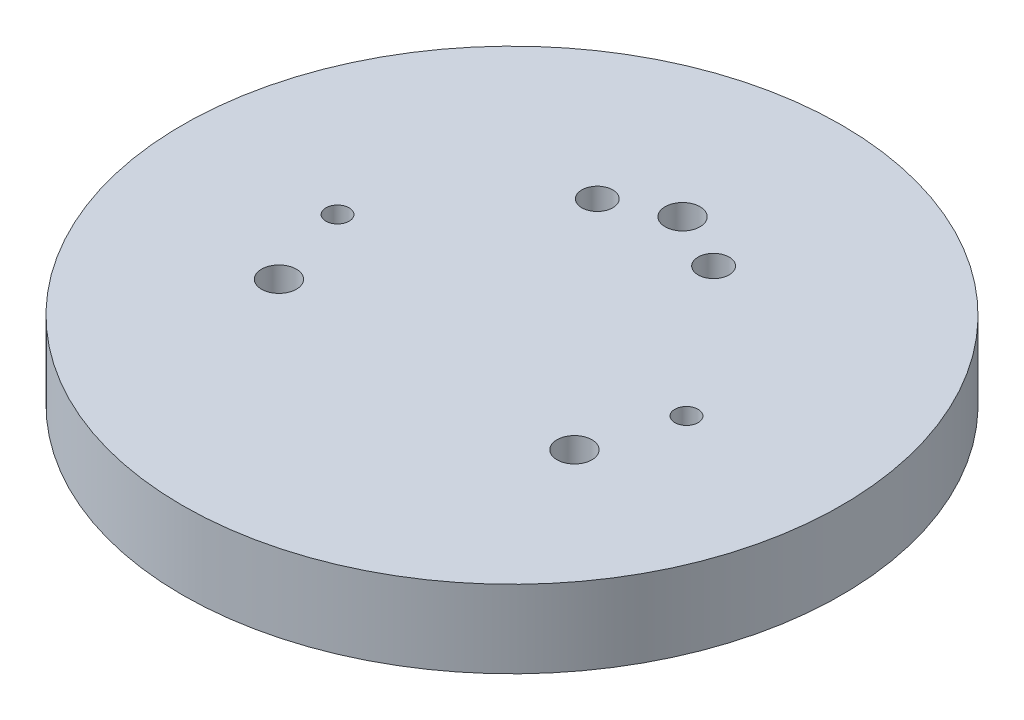
ISO-10303-21;
HEADER;
FILE_DESCRIPTION(('STEP AP214'),'2;1');
FILE_NAME('part.step','',(''),(''),'','','');
FILE_SCHEMA(('AUTOMOTIVE_DESIGN { 1 0 10303 214 1 1 1 1 }'));
ENDSEC;
DATA;
#1=APPLICATION_CONTEXT('core data for automotive mechanical design processes');
#2=APPLICATION_PROTOCOL_DEFINITION('international standard','automotive_design',2000,#1);
#3=PRODUCT_CONTEXT('',#1,'mechanical');
#4=PRODUCT('Part','Part','',(#3));
#5=PRODUCT_RELATED_PRODUCT_CATEGORY('part','',(#4));
#6=PRODUCT_DEFINITION_FORMATION('','',#4);
#7=PRODUCT_DEFINITION_CONTEXT('part definition',#1,'design');
#8=PRODUCT_DEFINITION('design','',#6,#7);
#9=PRODUCT_DEFINITION_SHAPE('','',#8);
#10=(LENGTH_UNIT() NAMED_UNIT(*) SI_UNIT(.MILLI.,.METRE.));
#11=(NAMED_UNIT(*) PLANE_ANGLE_UNIT() SI_UNIT($,.RADIAN.));
#12=(NAMED_UNIT(*) SI_UNIT($,.STERADIAN.) SOLID_ANGLE_UNIT());
#13=UNCERTAINTY_MEASURE_WITH_UNIT(LENGTH_MEASURE(1.E-05),#10,'distance_accuracy_value','');
#14=(GEOMETRIC_REPRESENTATION_CONTEXT(3) GLOBAL_UNCERTAINTY_ASSIGNED_CONTEXT((#13)) GLOBAL_UNIT_ASSIGNED_CONTEXT((#10,
#11,#12)) REPRESENTATION_CONTEXT('',''));
#15=CARTESIAN_POINT('',(0.,0.,0.));
#16=DIRECTION('',(0.,0.,1.));
#17=DIRECTION('',(1.,0.,0.));
#18=AXIS2_PLACEMENT_3D('',#15,#16,#17);
#19=CARTESIAN_POINT('',(-19.0525588832562,0.,11.0000000000008));
#20=DIRECTION('',(0.,1.,0.));
#21=DIRECTION('',(0.,0.,1.));
#22=AXIS2_PLACEMENT_3D('',#19,#20,#21);
#23=CYLINDRICAL_SURFACE('',#22,2.25000000000178);
#24=CARTESIAN_POINT('',(-19.0525588832562,10.,11.0000000000008));
#25=DIRECTION('',(0.,1.,0.));
#26=DIRECTION('',(0.,0.,1.));
#27=AXIS2_PLACEMENT_3D('',#24,#25,#26);
#28=CIRCLE('',#27,2.25000000000178);
#29=CARTESIAN_POINT('',(-19.0525588832562,10.,13.2500000000026));
#30=VERTEX_POINT('',#29);
#31=EDGE_CURVE('E70',#30,#30,#28,.T.);
#32=ORIENTED_EDGE('',*,*,#31,.T.);
#33=EDGE_LOOP('',(#32));
#34=FACE_BOUND('',#33,.T.);
#35=CARTESIAN_POINT('',(-19.0525588832562,4.4,11.0000000000008));
#36=DIRECTION('',(0.,-1.,0.));
#37=DIRECTION('',(0.,0.,-1.));
#38=AXIS2_PLACEMENT_3D('',#35,#36,#37);
#39=CIRCLE('',#38,2.25000000000178);
#40=CARTESIAN_POINT('',(-19.0525588832562,4.4,8.74999999999904));
#41=VERTEX_POINT('',#40);
#42=EDGE_CURVE('E40',#41,#41,#39,.F.);
#43=ORIENTED_EDGE('',*,*,#42,.F.);
#44=EDGE_LOOP('',(#43));
#45=FACE_BOUND('',#44,.T.);
#46=ADVANCED_FACE('F36',(#34,#45),#23,.F.);
#47=CARTESIAN_POINT('',(19.0525588832591,0.,10.9999999999992));
#48=DIRECTION('',(0.,1.,0.));
#49=DIRECTION('',(0.,0.,1.));
#50=AXIS2_PLACEMENT_3D('',#47,#48,#49);
#51=CYLINDRICAL_SURFACE('',#50,2.25000000000121);
#52=CARTESIAN_POINT('',(19.0525588832591,10.,10.9999999999992));
#53=DIRECTION('',(0.,1.,0.));
#54=DIRECTION('',(0.,0.,1.));
#55=AXIS2_PLACEMENT_3D('',#52,#53,#54);
#56=CIRCLE('',#55,2.25000000000121);
#57=CARTESIAN_POINT('',(19.0525588832591,10.,13.2500000000004));
#58=VERTEX_POINT('',#57);
#59=EDGE_CURVE('E76',#58,#58,#56,.T.);
#60=ORIENTED_EDGE('',*,*,#59,.T.);
#61=EDGE_LOOP('',(#60));
#62=FACE_BOUND('',#61,.T.);
#63=CARTESIAN_POINT('',(19.0525588832591,4.4,10.9999999999992));
#64=DIRECTION('',(0.,-1.,0.));
#65=DIRECTION('',(0.,0.,-1.));
#66=AXIS2_PLACEMENT_3D('',#63,#64,#65);
#67=CIRCLE('',#66,2.25000000000121);
#68=CARTESIAN_POINT('',(19.0525588832591,4.4,8.74999999999798));
#69=VERTEX_POINT('',#68);
#70=EDGE_CURVE('E61',#69,#69,#67,.F.);
#71=ORIENTED_EDGE('',*,*,#70,.F.);
#72=EDGE_LOOP('',(#71));
#73=FACE_BOUND('',#72,.T.);
#74=ADVANCED_FACE('F191',(#62,#73),#51,.F.);
#75=CARTESIAN_POINT('',(0.,0.,-22.));
#76=DIRECTION('',(0.,1.,0.));
#77=DIRECTION('',(0.,0.,1.));
#78=AXIS2_PLACEMENT_3D('',#75,#76,#77);
#79=CYLINDRICAL_SURFACE('',#78,2.25);
#80=CARTESIAN_POINT('',(0.,10.,-22.));
#81=DIRECTION('',(0.,1.,0.));
#82=DIRECTION('',(0.,0.,1.));
#83=AXIS2_PLACEMENT_3D('',#80,#81,#82);
#84=CIRCLE('',#83,2.25);
#85=CARTESIAN_POINT('',(0.,10.,-19.75));
#86=VERTEX_POINT('',#85);
#87=EDGE_CURVE('E83',#86,#86,#84,.T.);
#88=ORIENTED_EDGE('',*,*,#87,.T.);
#89=EDGE_LOOP('',(#88));
#90=FACE_BOUND('',#89,.T.);
#91=CARTESIAN_POINT('',(0.,4.4,-22.));
#92=DIRECTION('',(0.,-1.,0.));
#93=DIRECTION('',(0.,0.,-1.));
#94=AXIS2_PLACEMENT_3D('',#91,#92,#93);
#95=CIRCLE('',#94,2.25);
#96=CARTESIAN_POINT('',(0.,4.4,-24.25));
#97=VERTEX_POINT('',#96);
#98=EDGE_CURVE('E58',#97,#97,#95,.F.);
#99=ORIENTED_EDGE('',*,*,#98,.F.);
#100=EDGE_LOOP('',(#99));
#101=FACE_BOUND('',#100,.T.);
#102=ADVANCED_FACE('F196',(#90,#101),#79,.F.);
#103=CARTESIAN_POINT('',(0.,10.,0.));
#104=DIRECTION('',(0.,-1.,0.));
#105=DIRECTION('',(0.,0.,-1.));
#106=AXIS2_PLACEMENT_3D('',#103,#104,#105);
#107=CYLINDRICAL_SURFACE('',#106,42.5);
#108=CARTESIAN_POINT('',(0.,10.,0.));
#109=DIRECTION('',(0.,1.,0.));
#110=DIRECTION('',(0.,0.,1.));
#111=AXIS2_PLACEMENT_3D('',#108,#109,#110);
#112=CIRCLE('',#111,42.5);
#113=CARTESIAN_POINT('',(0.,10.,42.5));
#114=VERTEX_POINT('',#113);
#115=EDGE_CURVE('E10',#114,#114,#112,.T.);
#116=ORIENTED_EDGE('',*,*,#115,.F.);
#117=EDGE_LOOP('',(#116));
#118=FACE_BOUND('',#117,.T.);
#119=CARTESIAN_POINT('',(0.,0.,0.));
#120=DIRECTION('',(0.,1.,0.));
#121=DIRECTION('',(0.,0.,1.));
#122=AXIS2_PLACEMENT_3D('',#119,#120,#121);
#123=CIRCLE('',#122,42.5);
#124=CARTESIAN_POINT('',(0.,0.,42.5));
#125=VERTEX_POINT('',#124);
#126=EDGE_CURVE('E45',#125,#125,#123,.T.);
#127=ORIENTED_EDGE('',*,*,#126,.T.);
#128=EDGE_LOOP('',(#127));
#129=FACE_BOUND('',#128,.T.);
#130=ADVANCED_FACE('F38',(#118,#129),#107,.T.);
#131=CARTESIAN_POINT('',(0.,10.,0.));
#132=DIRECTION('',(0.,1.,0.));
#133=DIRECTION('',(0.,0.,1.));
#134=AXIS2_PLACEMENT_3D('',#131,#132,#133);
#135=PLANE('',#134);
#136=CARTESIAN_POINT('',(-7.5,10.,-18.5));
#137=DIRECTION('',(0.,1.,0.));
#138=DIRECTION('',(0.,0.,1.));
#139=AXIS2_PLACEMENT_3D('',#136,#137,#138);
#140=CIRCLE('',#139,2.);
#141=CARTESIAN_POINT('',(-7.5,10.,-16.5));
#142=VERTEX_POINT('',#141);
#143=EDGE_CURVE('E142',#142,#142,#140,.T.);
#144=ORIENTED_EDGE('',*,*,#143,.F.);
#145=EDGE_LOOP('',(#144));
#146=FACE_BOUND('',#145,.T.);
#147=CARTESIAN_POINT('',(7.5,10.,-18.5));
#148=DIRECTION('',(0.,1.,0.));
#149=DIRECTION('',(0.,0.,1.));
#150=AXIS2_PLACEMENT_3D('',#147,#148,#149);
#151=CIRCLE('',#150,2.);
#152=CARTESIAN_POINT('',(7.5,10.,-16.5));
#153=VERTEX_POINT('',#152);
#154=EDGE_CURVE('E134',#153,#153,#151,.T.);
#155=ORIENTED_EDGE('',*,*,#154,.F.);
#156=EDGE_LOOP('',(#155));
#157=FACE_BOUND('',#156,.T.);
#158=ORIENTED_EDGE('',*,*,#87,.F.);
#159=EDGE_LOOP('',(#158));
#160=FACE_BOUND('',#159,.T.);
#161=ORIENTED_EDGE('',*,*,#59,.F.);
#162=EDGE_LOOP('',(#161));
#163=FACE_BOUND('',#162,.T.);
#164=ORIENTED_EDGE('',*,*,#31,.F.);
#165=EDGE_LOOP('',(#164));
#166=FACE_BOUND('',#165,.T.);
#167=CARTESIAN_POINT('',(-22.5,10.,0.));
#168=DIRECTION('',(0.,1.,0.));
#169=DIRECTION('',(0.,0.,1.));
#170=AXIS2_PLACEMENT_3D('',#167,#168,#169);
#171=CIRCLE('',#170,1.5);
#172=CARTESIAN_POINT('',(-22.5,10.,1.5));
#173=VERTEX_POINT('',#172);
#174=EDGE_CURVE('E90',#173,#173,#171,.T.);
#175=ORIENTED_EDGE('',*,*,#174,.F.);
#176=EDGE_LOOP('',(#175));
#177=FACE_BOUND('',#176,.T.);
#178=CARTESIAN_POINT('',(22.5,10.,0.));
#179=DIRECTION('',(0.,1.,0.));
#180=DIRECTION('',(0.,0.,1.));
#181=AXIS2_PLACEMENT_3D('',#178,#179,#180);
#182=CIRCLE('',#181,1.5);
#183=CARTESIAN_POINT('',(22.5,10.,1.49999999999999));
#184=VERTEX_POINT('',#183);
#185=EDGE_CURVE('E55',#184,#184,#182,.T.);
#186=ORIENTED_EDGE('',*,*,#185,.F.);
#187=EDGE_LOOP('',(#186));
#188=FACE_BOUND('',#187,.T.);
#189=ORIENTED_EDGE('',*,*,#115,.T.);
#190=EDGE_LOOP('',(#189));
#191=FACE_BOUND('',#190,.T.);
#192=ADVANCED_FACE('F161',(#146,#157,#160,#163,#166,#177,#188,#191),#135,.T.);
#193=CARTESIAN_POINT('',(0.,0.,0.));
#194=DIRECTION('',(0.,1.,0.));
#195=DIRECTION('',(0.,0.,1.));
#196=AXIS2_PLACEMENT_3D('',#193,#194,#195);
#197=PLANE('',#196);
#198=CARTESIAN_POINT('',(-7.5,0.,-18.5));
#199=DIRECTION('',(0.,1.,0.));
#200=DIRECTION('',(0.,0.,1.));
#201=AXIS2_PLACEMENT_3D('',#198,#199,#200);
#202=CIRCLE('',#201,2.);
#203=CARTESIAN_POINT('',(-7.5,0.,-16.5));
#204=VERTEX_POINT('',#203);
#205=EDGE_CURVE('E115',#204,#204,#202,.T.);
#206=ORIENTED_EDGE('',*,*,#205,.T.);
#207=EDGE_LOOP('',(#206));
#208=FACE_BOUND('',#207,.T.);
#209=CARTESIAN_POINT('',(7.5,0.,-18.5));
#210=DIRECTION('',(0.,1.,0.));
#211=DIRECTION('',(0.,0.,1.));
#212=AXIS2_PLACEMENT_3D('',#209,#210,#211);
#213=CIRCLE('',#212,2.);
#214=CARTESIAN_POINT('',(7.5,0.,-16.5));
#215=VERTEX_POINT('',#214);
#216=EDGE_CURVE('E138',#215,#215,#213,.T.);
#217=ORIENTED_EDGE('',*,*,#216,.T.);
#218=EDGE_LOOP('',(#217));
#219=FACE_BOUND('',#218,.T.);
#220=CARTESIAN_POINT('',(0.,0.,-22.));
#221=DIRECTION('',(0.,-1.,0.));
#222=DIRECTION('',(0.,0.,-1.));
#223=AXIS2_PLACEMENT_3D('',#220,#221,#222);
#224=CIRCLE('',#223,5.);
#225=CARTESIAN_POINT('',(0.,0.,-27.));
#226=VERTEX_POINT('',#225);
#227=EDGE_CURVE('E127',#226,#226,#224,.T.);
#228=ORIENTED_EDGE('',*,*,#227,.F.);
#229=EDGE_LOOP('',(#228));
#230=FACE_BOUND('',#229,.T.);
#231=CARTESIAN_POINT('',(19.0525588832591,0.,10.9999999999992));
#232=DIRECTION('',(0.,-1.,0.));
#233=DIRECTION('',(0.,0.,-1.));
#234=AXIS2_PLACEMENT_3D('',#231,#232,#233);
#235=CIRCLE('',#234,5.);
#236=CARTESIAN_POINT('',(19.0525588832591,0.,5.99999999999918));
#237=VERTEX_POINT('',#236);
#238=EDGE_CURVE('E119',#237,#237,#235,.T.);
#239=ORIENTED_EDGE('',*,*,#238,.F.);
#240=EDGE_LOOP('',(#239));
#241=FACE_BOUND('',#240,.T.);
#242=CARTESIAN_POINT('',(-19.0525588832562,0.,11.0000000000008));
#243=DIRECTION('',(0.,-1.,0.));
#244=DIRECTION('',(0.,0.,-1.));
#245=AXIS2_PLACEMENT_3D('',#242,#243,#244);
#246=CIRCLE('',#245,5.);
#247=CARTESIAN_POINT('',(-19.0525588832562,0.,6.00000000000082));
#248=VERTEX_POINT('',#247);
#249=EDGE_CURVE('E110',#248,#248,#246,.T.);
#250=ORIENTED_EDGE('',*,*,#249,.F.);
#251=EDGE_LOOP('',(#250));
#252=FACE_BOUND('',#251,.T.);
#253=ORIENTED_EDGE('',*,*,#126,.F.);
#254=EDGE_LOOP('',(#253));
#255=FACE_BOUND('',#254,.T.);
#256=ADVANCED_FACE('F151',(#208,#219,#230,#241,#252,#255),#197,.F.);
#257=CARTESIAN_POINT('',(22.5,5.,0.));
#258=DIRECTION('',(0.,1.,0.));
#259=DIRECTION('',(0.,0.,1.));
#260=AXIS2_PLACEMENT_3D('',#257,#258,#259);
#261=CYLINDRICAL_SURFACE('',#260,1.5);
#262=CARTESIAN_POINT('',(22.5,5.,0.));
#263=DIRECTION('',(0.,1.,0.));
#264=DIRECTION('',(0.,0.,1.));
#265=AXIS2_PLACEMENT_3D('',#262,#263,#264);
#266=CIRCLE('',#265,1.5);
#267=CARTESIAN_POINT('',(22.5,5.,1.49999999999999));
#268=VERTEX_POINT('',#267);
#269=EDGE_CURVE('E93',#268,#268,#266,.T.);
#270=ORIENTED_EDGE('',*,*,#269,.F.);
#271=EDGE_LOOP('',(#270));
#272=FACE_BOUND('',#271,.T.);
#273=ORIENTED_EDGE('',*,*,#185,.T.);
#274=EDGE_LOOP('',(#273));
#275=FACE_BOUND('',#274,.T.);
#276=ADVANCED_FACE('F187',(#272,#275),#261,.F.);
#277=CARTESIAN_POINT('',(22.5,5.,0.));
#278=DIRECTION('',(0.,1.,0.));
#279=DIRECTION('',(0.,0.,1.));
#280=AXIS2_PLACEMENT_3D('',#277,#278,#279);
#281=PLANE('',#280);
#282=ORIENTED_EDGE('',*,*,#269,.T.);
#283=EDGE_LOOP('',(#282));
#284=FACE_BOUND('',#283,.T.);
#285=ADVANCED_FACE('F177',(#284),#281,.T.);
#286=CARTESIAN_POINT('',(-22.5,5.,0.));
#287=DIRECTION('',(0.,1.,0.));
#288=DIRECTION('',(0.,0.,1.));
#289=AXIS2_PLACEMENT_3D('',#286,#287,#288);
#290=CYLINDRICAL_SURFACE('',#289,1.5);
#291=CARTESIAN_POINT('',(-22.5,5.,0.));
#292=DIRECTION('',(0.,1.,0.));
#293=DIRECTION('',(0.,0.,1.));
#294=AXIS2_PLACEMENT_3D('',#291,#292,#293);
#295=CIRCLE('',#294,1.5);
#296=CARTESIAN_POINT('',(-22.5,5.,1.5));
#297=VERTEX_POINT('',#296);
#298=EDGE_CURVE('E52',#297,#297,#295,.T.);
#299=ORIENTED_EDGE('',*,*,#298,.F.);
#300=EDGE_LOOP('',(#299));
#301=FACE_BOUND('',#300,.T.);
#302=ORIENTED_EDGE('',*,*,#174,.T.);
#303=EDGE_LOOP('',(#302));
#304=FACE_BOUND('',#303,.T.);
#305=ADVANCED_FACE('F174',(#301,#304),#290,.F.);
#306=CARTESIAN_POINT('',(-22.5,5.,0.));
#307=DIRECTION('',(0.,1.,0.));
#308=DIRECTION('',(0.,0.,1.));
#309=AXIS2_PLACEMENT_3D('',#306,#307,#308);
#310=PLANE('',#309);
#311=ORIENTED_EDGE('',*,*,#298,.T.);
#312=EDGE_LOOP('',(#311));
#313=FACE_BOUND('',#312,.T.);
#314=ADVANCED_FACE('F176',(#313),#310,.T.);
#315=CARTESIAN_POINT('',(0.,4.4,-22.));
#316=DIRECTION('',(0.,-1.,0.));
#317=DIRECTION('',(0.,0.,-1.));
#318=AXIS2_PLACEMENT_3D('',#315,#316,#317);
#319=PLANE('',#318);
#320=CARTESIAN_POINT('',(0.,4.4,-22.));
#321=DIRECTION('',(0.,-1.,0.));
#322=DIRECTION('',(0.,0.,-1.));
#323=AXIS2_PLACEMENT_3D('',#320,#321,#322);
#324=CIRCLE('',#323,5.);
#325=CARTESIAN_POINT('',(0.,4.4,-27.));
#326=VERTEX_POINT('',#325);
#327=EDGE_CURVE('E62',#326,#326,#324,.T.);
#328=ORIENTED_EDGE('',*,*,#327,.T.);
#329=EDGE_LOOP('',(#328));
#330=FACE_BOUND('',#329,.T.);
#331=ORIENTED_EDGE('',*,*,#98,.T.);
#332=EDGE_LOOP('',(#331));
#333=FACE_BOUND('',#332,.T.);
#334=ADVANCED_FACE('F184',(#330,#333),#319,.T.);
#335=CARTESIAN_POINT('',(0.,4.4,-22.));
#336=DIRECTION('',(0.,-1.,0.));
#337=DIRECTION('',(0.,0.,-1.));
#338=AXIS2_PLACEMENT_3D('',#335,#336,#337);
#339=CYLINDRICAL_SURFACE('',#338,5.);
#340=ORIENTED_EDGE('',*,*,#327,.F.);
#341=EDGE_LOOP('',(#340));
#342=FACE_BOUND('',#341,.T.);
#343=ORIENTED_EDGE('',*,*,#227,.T.);
#344=EDGE_LOOP('',(#343));
#345=FACE_BOUND('',#344,.T.);
#346=ADVANCED_FACE('F218',(#342,#345),#339,.F.);
#347=CARTESIAN_POINT('',(19.0525588832591,4.4,10.9999999999992));
#348=DIRECTION('',(0.,-1.,0.));
#349=DIRECTION('',(0.,0.,-1.));
#350=AXIS2_PLACEMENT_3D('',#347,#348,#349);
#351=PLANE('',#350);
#352=CARTESIAN_POINT('',(19.0525588832591,4.4,10.9999999999992));
#353=DIRECTION('',(0.,-1.,0.));
#354=DIRECTION('',(0.,0.,-1.));
#355=AXIS2_PLACEMENT_3D('',#352,#353,#354);
#356=CIRCLE('',#355,5.);
#357=CARTESIAN_POINT('',(19.0525588832591,4.4,5.99999999999918));
#358=VERTEX_POINT('',#357);
#359=EDGE_CURVE('E123',#358,#358,#356,.T.);
#360=ORIENTED_EDGE('',*,*,#359,.T.);
#361=EDGE_LOOP('',(#360));
#362=FACE_BOUND('',#361,.T.);
#363=ORIENTED_EDGE('',*,*,#70,.T.);
#364=EDGE_LOOP('',(#363));
#365=FACE_BOUND('',#364,.T.);
#366=ADVANCED_FACE('F214',(#362,#365),#351,.T.);
#367=CARTESIAN_POINT('',(19.0525588832591,4.4,10.9999999999992));
#368=DIRECTION('',(0.,-1.,0.));
#369=DIRECTION('',(0.,0.,-1.));
#370=AXIS2_PLACEMENT_3D('',#367,#368,#369);
#371=CYLINDRICAL_SURFACE('',#370,5.);
#372=ORIENTED_EDGE('',*,*,#359,.F.);
#373=EDGE_LOOP('',(#372));
#374=FACE_BOUND('',#373,.T.);
#375=ORIENTED_EDGE('',*,*,#238,.T.);
#376=EDGE_LOOP('',(#375));
#377=FACE_BOUND('',#376,.T.);
#378=ADVANCED_FACE('F210',(#374,#377),#371,.F.);
#379=CARTESIAN_POINT('',(-19.0525588832562,4.4,11.0000000000008));
#380=DIRECTION('',(0.,-1.,0.));
#381=DIRECTION('',(0.,0.,-1.));
#382=AXIS2_PLACEMENT_3D('',#379,#380,#381);
#383=PLANE('',#382);
#384=CARTESIAN_POINT('',(-19.0525588832562,4.4,11.0000000000008));
#385=DIRECTION('',(0.,-1.,0.));
#386=DIRECTION('',(0.,0.,-1.));
#387=AXIS2_PLACEMENT_3D('',#384,#385,#386);
#388=CIRCLE('',#387,5.);
#389=CARTESIAN_POINT('',(-19.0525588832562,4.4,6.00000000000082));
#390=VERTEX_POINT('',#389);
#391=EDGE_CURVE('E114',#390,#390,#388,.T.);
#392=ORIENTED_EDGE('',*,*,#391,.T.);
#393=EDGE_LOOP('',(#392));
#394=FACE_BOUND('',#393,.T.);
#395=ORIENTED_EDGE('',*,*,#42,.T.);
#396=EDGE_LOOP('',(#395));
#397=FACE_BOUND('',#396,.T.);
#398=ADVANCED_FACE('F206',(#394,#397),#383,.T.);
#399=CARTESIAN_POINT('',(-19.0525588832562,4.4,11.0000000000008));
#400=DIRECTION('',(0.,-1.,0.));
#401=DIRECTION('',(0.,0.,-1.));
#402=AXIS2_PLACEMENT_3D('',#399,#400,#401);
#403=CYLINDRICAL_SURFACE('',#402,5.);
#404=ORIENTED_EDGE('',*,*,#391,.F.);
#405=EDGE_LOOP('',(#404));
#406=FACE_BOUND('',#405,.T.);
#407=ORIENTED_EDGE('',*,*,#249,.T.);
#408=EDGE_LOOP('',(#407));
#409=FACE_BOUND('',#408,.T.);
#410=ADVANCED_FACE('F203',(#406,#409),#403,.F.);
#411=CARTESIAN_POINT('',(7.5,0.,-18.5));
#412=DIRECTION('',(0.,1.,0.));
#413=DIRECTION('',(0.,0.,1.));
#414=AXIS2_PLACEMENT_3D('',#411,#412,#413);
#415=CYLINDRICAL_SURFACE('',#414,2.);
#416=ORIENTED_EDGE('',*,*,#216,.F.);
#417=EDGE_LOOP('',(#416));
#418=FACE_BOUND('',#417,.T.);
#419=ORIENTED_EDGE('',*,*,#154,.T.);
#420=EDGE_LOOP('',(#419));
#421=FACE_BOUND('',#420,.T.);
#422=ADVANCED_FACE('F157',(#418,#421),#415,.F.);
#423=CARTESIAN_POINT('',(-7.5,0.,-18.5));
#424=DIRECTION('',(0.,1.,0.));
#425=DIRECTION('',(0.,0.,1.));
#426=AXIS2_PLACEMENT_3D('',#423,#424,#425);
#427=CYLINDRICAL_SURFACE('',#426,2.);
#428=ORIENTED_EDGE('',*,*,#205,.F.);
#429=EDGE_LOOP('',(#428));
#430=FACE_BOUND('',#429,.T.);
#431=ORIENTED_EDGE('',*,*,#143,.T.);
#432=EDGE_LOOP('',(#431));
#433=FACE_BOUND('',#432,.T.);
#434=ADVANCED_FACE('F154',(#430,#433),#427,.F.);
#435=CLOSED_SHELL('',(#46,#74,#102,#130,#192,#256,#276,#285,#305,#314,#334,#346,#366,#378,#398,
#410,#422,#434));
#436=MANIFOLD_SOLID_BREP('B2',#435);
#437=ADVANCED_BREP_SHAPE_REPRESENTATION('',(#18,#436),#14);
#438=SHAPE_DEFINITION_REPRESENTATION(#9,#437);
ENDSEC;
END-ISO-10303-21;
